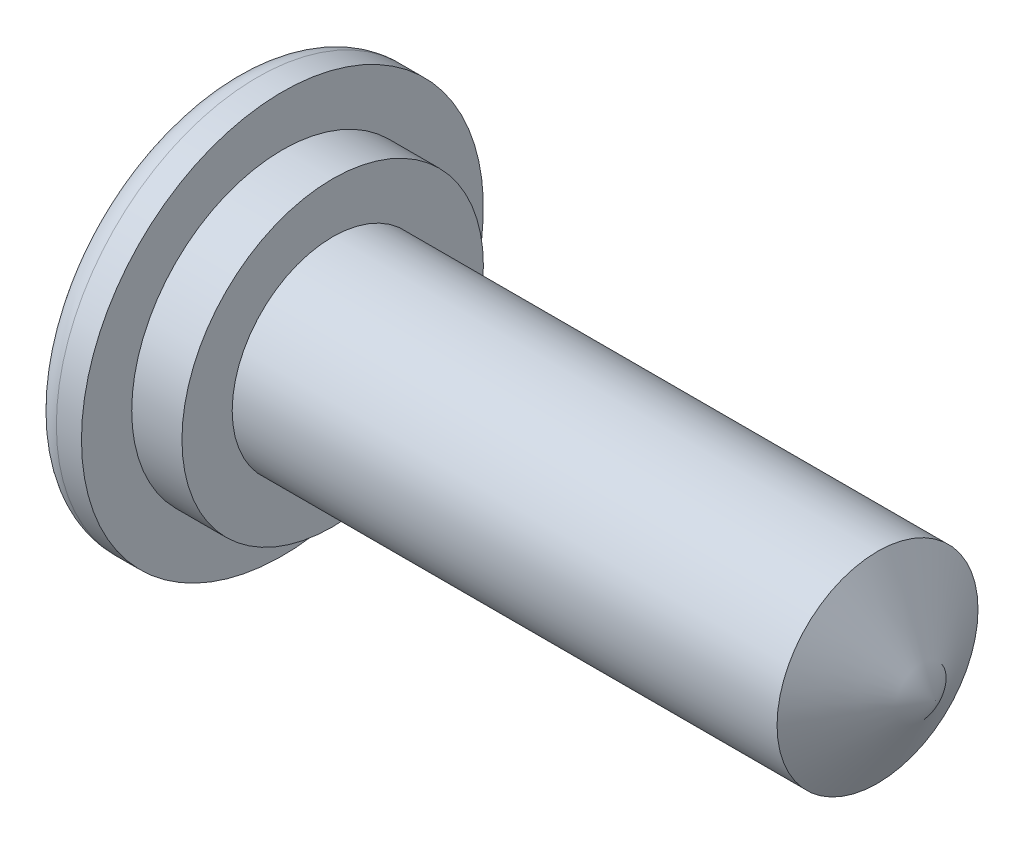
ISO-10303-21;
HEADER;
FILE_DESCRIPTION(('STEP AP214'),'2;1');
FILE_NAME('part.step','',(''),(''),'','','');
FILE_SCHEMA(('AUTOMOTIVE_DESIGN { 1 0 10303 214 1 1 1 1 }'));
ENDSEC;
DATA;
#1=APPLICATION_CONTEXT('core data for automotive mechanical design processes');
#2=APPLICATION_PROTOCOL_DEFINITION('international standard','automotive_design',2000,#1);
#3=PRODUCT_CONTEXT('',#1,'mechanical');
#4=PRODUCT('Part','Part','',(#3));
#5=PRODUCT_RELATED_PRODUCT_CATEGORY('part','',(#4));
#6=PRODUCT_DEFINITION_FORMATION('','',#4);
#7=PRODUCT_DEFINITION_CONTEXT('part definition',#1,'design');
#8=PRODUCT_DEFINITION('design','',#6,#7);
#9=PRODUCT_DEFINITION_SHAPE('','',#8);
#10=(LENGTH_UNIT() NAMED_UNIT(*) SI_UNIT(.MILLI.,.METRE.));
#11=(NAMED_UNIT(*) PLANE_ANGLE_UNIT() SI_UNIT($,.RADIAN.));
#12=(NAMED_UNIT(*) SI_UNIT($,.STERADIAN.) SOLID_ANGLE_UNIT());
#13=UNCERTAINTY_MEASURE_WITH_UNIT(LENGTH_MEASURE(1.E-05),#10,'distance_accuracy_value','');
#14=(GEOMETRIC_REPRESENTATION_CONTEXT(3) GLOBAL_UNCERTAINTY_ASSIGNED_CONTEXT((#13)) GLOBAL_UNIT_ASSIGNED_CONTEXT((#10,
#11,#12)) REPRESENTATION_CONTEXT('',''));
#15=CARTESIAN_POINT('',(0.,0.,0.));
#16=DIRECTION('',(0.,0.,1.));
#17=DIRECTION('',(1.,0.,0.));
#18=AXIS2_PLACEMENT_3D('',#15,#16,#17);
#19=CARTESIAN_POINT('',(0.,3.,0.));
#20=DIRECTION('',(-1.,0.,0.));
#21=DIRECTION('',(0.,0.,1.));
#22=AXIS2_PLACEMENT_3D('',#19,#20,#21);
#23=PLANE('',#22);
#24=CARTESIAN_POINT('',(0.,0.,0.));
#25=DIRECTION('',(-1.,0.,0.));
#26=DIRECTION('',(0.,0.,1.));
#27=AXIS2_PLACEMENT_3D('',#24,#25,#26);
#28=CIRCLE('',#27,4.);
#29=CARTESIAN_POINT('',(0.,0.,4.));
#30=VERTEX_POINT('',#29);
#31=EDGE_CURVE('E97',#30,#30,#28,.T.);
#32=ORIENTED_EDGE('',*,*,#31,.F.);
#33=EDGE_LOOP('',(#32));
#34=FACE_BOUND('',#33,.T.);
#35=CARTESIAN_POINT('',(0.,0.,0.));
#36=DIRECTION('',(-1.,0.,0.));
#37=DIRECTION('',(0.,0.,1.));
#38=AXIS2_PLACEMENT_3D('',#35,#36,#37);
#39=CIRCLE('',#38,3.);
#40=CARTESIAN_POINT('',(0.,0.,3.));
#41=VERTEX_POINT('',#40);
#42=EDGE_CURVE('E11',#41,#41,#39,.T.);
#43=ORIENTED_EDGE('',*,*,#42,.T.);
#44=EDGE_LOOP('',(#43));
#45=FACE_BOUND('',#44,.T.);
#46=ADVANCED_FACE('F32',(#34,#45),#23,.F.);
#47=CARTESIAN_POINT('',(-8.53757094211124,0.,0.));
#48=DIRECTION('',(-1.,0.,0.));
#49=DIRECTION('',(0.,0.,1.));
#50=AXIS2_PLACEMENT_3D('',#47,#48,#49);
#51=CYLINDRICAL_SURFACE('',#50,3.);
#52=ORIENTED_EDGE('',*,*,#42,.F.);
#53=EDGE_LOOP('',(#52));
#54=FACE_BOUND('',#53,.T.);
#55=CARTESIAN_POINT('',(1.,0.,0.));
#56=DIRECTION('',(-1.,0.,0.));
#57=DIRECTION('',(0.,0.,1.));
#58=AXIS2_PLACEMENT_3D('',#55,#56,#57);
#59=CIRCLE('',#58,3.);
#60=CARTESIAN_POINT('',(1.,0.,3.));
#61=VERTEX_POINT('',#60);
#62=EDGE_CURVE('E39',#61,#61,#59,.T.);
#63=ORIENTED_EDGE('',*,*,#62,.T.);
#64=EDGE_LOOP('',(#63));
#65=FACE_BOUND('',#64,.T.);
#66=ADVANCED_FACE('F70',(#54,#65),#51,.T.);
#67=CARTESIAN_POINT('',(1.,3.,0.));
#68=DIRECTION('',(-1.,0.,0.));
#69=DIRECTION('',(0.,0.,1.));
#70=AXIS2_PLACEMENT_3D('',#67,#68,#69);
#71=PLANE('',#70);
#72=ORIENTED_EDGE('',*,*,#62,.F.);
#73=EDGE_LOOP('',(#72));
#74=FACE_BOUND('',#73,.T.);
#75=CARTESIAN_POINT('',(1.,0.,0.));
#76=DIRECTION('',(-1.,0.,0.));
#77=DIRECTION('',(0.,0.,1.));
#78=AXIS2_PLACEMENT_3D('',#75,#76,#77);
#79=CIRCLE('',#78,2.);
#80=CARTESIAN_POINT('',(1.,0.,2.));
#81=VERTEX_POINT('',#80);
#82=EDGE_CURVE('E59',#81,#81,#79,.T.);
#83=ORIENTED_EDGE('',*,*,#82,.T.);
#84=EDGE_LOOP('',(#83));
#85=FACE_BOUND('',#84,.T.);
#86=ADVANCED_FACE('F72',(#74,#85),#71,.F.);
#87=CARTESIAN_POINT('',(-8.53757094211124,0.,0.));
#88=DIRECTION('',(-1.,0.,0.));
#89=DIRECTION('',(0.,0.,1.));
#90=AXIS2_PLACEMENT_3D('',#87,#88,#89);
#91=CYLINDRICAL_SURFACE('',#90,2.);
#92=ORIENTED_EDGE('',*,*,#82,.F.);
#93=EDGE_LOOP('',(#92));
#94=FACE_BOUND('',#93,.T.);
#95=CARTESIAN_POINT('',(11.8452994616208,0.,0.));
#96=DIRECTION('',(-1.,0.,0.));
#97=DIRECTION('',(0.,0.,1.));
#98=AXIS2_PLACEMENT_3D('',#95,#96,#97);
#99=CIRCLE('',#98,2.);
#100=CARTESIAN_POINT('',(11.8452994616208,0.,2.));
#101=VERTEX_POINT('',#100);
#102=EDGE_CURVE('E55',#101,#101,#99,.T.);
#103=ORIENTED_EDGE('',*,*,#102,.T.);
#104=EDGE_LOOP('',(#103));
#105=FACE_BOUND('',#104,.T.);
#106=ADVANCED_FACE('F75',(#94,#105),#91,.T.);
#107=CARTESIAN_POINT('',(13.,0.,0.));
#108=DIRECTION('',(-1.,0.,0.));
#109=DIRECTION('',(0.,0.,1.));
#110=AXIS2_PLACEMENT_3D('',#107,#108,#109);
#111=CONICAL_SURFACE('',#110,0.,1.0471975511966);
#112=ORIENTED_EDGE('',*,*,#102,.F.);
#113=EDGE_LOOP('',(#112));
#114=FACE_BOUND('',#113,.T.);
#115=CARTESIAN_POINT('',(13.,0.,0.));
#116=VERTEX_POINT('',#115);
#117=VERTEX_LOOP('',#116);
#118=FACE_BOUND('',#117,.T.);
#119=ADVANCED_FACE('F49',(#114,#118),#111,.T.);
#120=CARTESIAN_POINT('',(0.,0.,0.));
#121=DIRECTION('',(-1.,0.,0.));
#122=DIRECTION('',(0.,0.,1.));
#123=AXIS2_PLACEMENT_3D('',#120,#121,#122);
#124=CONICAL_SURFACE('',#123,2.,1.04719755119659);
#125=CARTESIAN_POINT('',(1.15470053837926,0.,0.));
#126=VERTEX_POINT('',#125);
#127=VERTEX_LOOP('',#126);
#128=FACE_BOUND('',#127,.T.);
#129=CARTESIAN_POINT('',(0.,0.,0.));
#130=DIRECTION('',(-1.,0.,0.));
#131=DIRECTION('',(0.,0.,1.));
#132=AXIS2_PLACEMENT_3D('',#129,#130,#131);
#133=CIRCLE('',#132,2.);
#134=CARTESIAN_POINT('',(0.,0.,2.));
#135=VERTEX_POINT('',#134);
#136=EDGE_CURVE('E53',#135,#135,#133,.T.);
#137=ORIENTED_EDGE('',*,*,#136,.T.);
#138=EDGE_LOOP('',(#137));
#139=FACE_BOUND('',#138,.T.);
#140=ADVANCED_FACE('F45',(#128,#139),#124,.F.);
#141=CARTESIAN_POINT('',(-8.53757094211124,0.,0.));
#142=DIRECTION('',(-1.,0.,0.));
#143=DIRECTION('',(0.,0.,1.));
#144=AXIS2_PLACEMENT_3D('',#141,#142,#143);
#145=CYLINDRICAL_SURFACE('',#144,2.);
#146=ORIENTED_EDGE('',*,*,#136,.F.);
#147=EDGE_LOOP('',(#146));
#148=FACE_BOUND('',#147,.T.);
#149=CARTESIAN_POINT('',(-0.499999999999997,0.,0.));
#150=DIRECTION('',(-1.,0.,0.));
#151=DIRECTION('',(0.,0.,1.));
#152=AXIS2_PLACEMENT_3D('',#149,#150,#151);
#153=CIRCLE('',#152,2.);
#154=CARTESIAN_POINT('',(-0.499999999999997,0.,2.));
#155=VERTEX_POINT('',#154);
#156=EDGE_CURVE('E56',#155,#155,#153,.T.);
#157=ORIENTED_EDGE('',*,*,#156,.T.);
#158=EDGE_LOOP('',(#157));
#159=FACE_BOUND('',#158,.T.);
#160=ADVANCED_FACE('F48',(#148,#159),#145,.F.);
#161=CARTESIAN_POINT('',(-0.5,0.,0.));
#162=DIRECTION('',(-1.,0.,0.));
#163=DIRECTION('',(0.,0.,1.));
#164=AXIS2_PLACEMENT_3D('',#161,#162,#163);
#165=TOROIDAL_SURFACE('',#164,2.5,0.5);
#166=ORIENTED_EDGE('',*,*,#156,.F.);
#167=EDGE_LOOP('',(#166));
#168=FACE_BOUND('',#167,.T.);
#169=CARTESIAN_POINT('',(-1.,0.,0.));
#170=DIRECTION('',(-1.,0.,0.));
#171=DIRECTION('',(0.,0.,1.));
#172=AXIS2_PLACEMENT_3D('',#169,#170,#171);
#173=CIRCLE('',#172,2.5);
#174=CARTESIAN_POINT('',(-1.,0.,2.5));
#175=VERTEX_POINT('',#174);
#176=EDGE_CURVE('E62',#175,#175,#173,.T.);
#177=ORIENTED_EDGE('',*,*,#176,.T.);
#178=EDGE_LOOP('',(#177));
#179=FACE_BOUND('',#178,.T.);
#180=ADVANCED_FACE('F110',(#168,#179),#165,.T.);
#181=CARTESIAN_POINT('',(-1.,2.5,0.));
#182=DIRECTION('',(1.,0.,0.));
#183=DIRECTION('',(0.,0.,-1.));
#184=AXIS2_PLACEMENT_3D('',#181,#182,#183);
#185=PLANE('',#184);
#186=ORIENTED_EDGE('',*,*,#176,.F.);
#187=EDGE_LOOP('',(#186));
#188=FACE_BOUND('',#187,.T.);
#189=CARTESIAN_POINT('',(-1.,0.,0.));
#190=DIRECTION('',(-1.,0.,0.));
#191=DIRECTION('',(0.,0.,1.));
#192=AXIS2_PLACEMENT_3D('',#189,#190,#191);
#193=CIRCLE('',#192,3.5);
#194=CARTESIAN_POINT('',(-1.,0.,3.5));
#195=VERTEX_POINT('',#194);
#196=EDGE_CURVE('E103',#195,#195,#193,.T.);
#197=ORIENTED_EDGE('',*,*,#196,.T.);
#198=EDGE_LOOP('',(#197));
#199=FACE_BOUND('',#198,.T.);
#200=ADVANCED_FACE('F112',(#188,#199),#185,.F.);
#201=CARTESIAN_POINT('',(-0.5,0.,0.));
#202=DIRECTION('',(-1.,0.,0.));
#203=DIRECTION('',(0.,0.,1.));
#204=AXIS2_PLACEMENT_3D('',#201,#202,#203);
#205=TOROIDAL_SURFACE('',#204,3.5,0.5);
#206=ORIENTED_EDGE('',*,*,#196,.F.);
#207=EDGE_LOOP('',(#206));
#208=FACE_BOUND('',#207,.T.);
#209=CARTESIAN_POINT('',(-0.499999999999997,0.,0.));
#210=DIRECTION('',(-1.,0.,0.));
#211=DIRECTION('',(0.,0.,1.));
#212=AXIS2_PLACEMENT_3D('',#209,#210,#211);
#213=CIRCLE('',#212,4.);
#214=CARTESIAN_POINT('',(-0.499999999999997,0.,4.));
#215=VERTEX_POINT('',#214);
#216=EDGE_CURVE('E100',#215,#215,#213,.T.);
#217=ORIENTED_EDGE('',*,*,#216,.T.);
#218=EDGE_LOOP('',(#217));
#219=FACE_BOUND('',#218,.T.);
#220=ADVANCED_FACE('F115',(#208,#219),#205,.T.);
#221=CARTESIAN_POINT('',(-8.53757094211124,0.,0.));
#222=DIRECTION('',(-1.,0.,0.));
#223=DIRECTION('',(0.,0.,1.));
#224=AXIS2_PLACEMENT_3D('',#221,#222,#223);
#225=CYLINDRICAL_SURFACE('',#224,4.);
#226=ORIENTED_EDGE('',*,*,#216,.F.);
#227=EDGE_LOOP('',(#226));
#228=FACE_BOUND('',#227,.T.);
#229=ORIENTED_EDGE('',*,*,#31,.T.);
#230=EDGE_LOOP('',(#229));
#231=FACE_BOUND('',#230,.T.);
#232=ADVANCED_FACE('F121',(#228,#231),#225,.T.);
#233=CLOSED_SHELL('',(#46,#66,#86,#106,#119,#140,#160,#180,#200,#220,#232));
#234=MANIFOLD_SOLID_BREP('B2',#233);
#235=ADVANCED_BREP_SHAPE_REPRESENTATION('',(#18,#234),#14);
#236=SHAPE_DEFINITION_REPRESENTATION(#9,#235);
ENDSEC;
END-ISO-10303-21;
